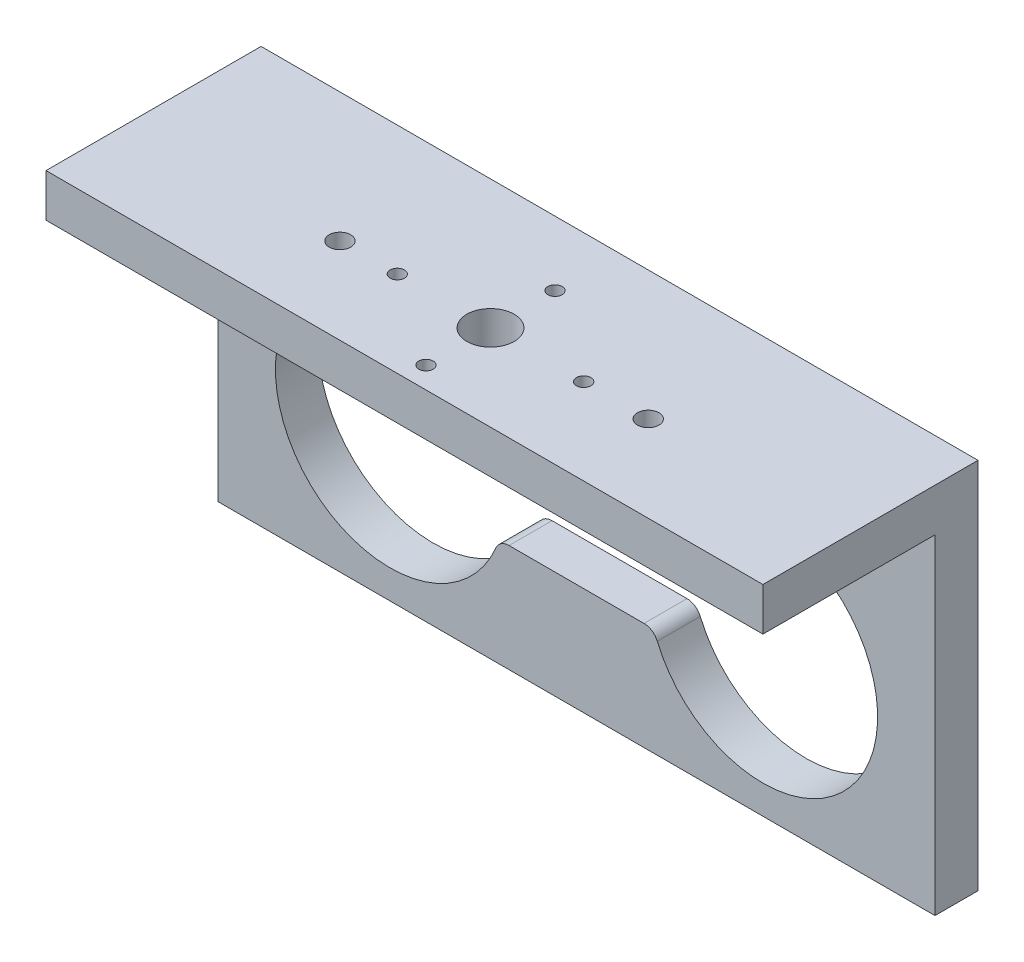
ISO-10303-21;
HEADER;
FILE_DESCRIPTION(('STEP AP214'),'2;1');
FILE_NAME('part.step','',(''),(''),'','','');
FILE_SCHEMA(('AUTOMOTIVE_DESIGN { 1 0 10303 214 1 1 1 1 }'));
ENDSEC;
DATA;
#1=APPLICATION_CONTEXT('core data for automotive mechanical design processes');
#2=APPLICATION_PROTOCOL_DEFINITION('international standard','automotive_design',2000,#1);
#3=PRODUCT_CONTEXT('',#1,'mechanical');
#4=PRODUCT('Part','Part','',(#3));
#5=PRODUCT_RELATED_PRODUCT_CATEGORY('part','',(#4));
#6=PRODUCT_DEFINITION_FORMATION('','',#4);
#7=PRODUCT_DEFINITION_CONTEXT('part definition',#1,'design');
#8=PRODUCT_DEFINITION('design','',#6,#7);
#9=PRODUCT_DEFINITION_SHAPE('','',#8);
#10=(LENGTH_UNIT() NAMED_UNIT(*) SI_UNIT(.MILLI.,.METRE.));
#11=(NAMED_UNIT(*) PLANE_ANGLE_UNIT() SI_UNIT($,.RADIAN.));
#12=(NAMED_UNIT(*) SI_UNIT($,.STERADIAN.) SOLID_ANGLE_UNIT());
#13=UNCERTAINTY_MEASURE_WITH_UNIT(LENGTH_MEASURE(1.E-05),#10,'distance_accuracy_value','');
#14=(GEOMETRIC_REPRESENTATION_CONTEXT(3) GLOBAL_UNCERTAINTY_ASSIGNED_CONTEXT((#13)) GLOBAL_UNIT_ASSIGNED_CONTEXT((#10,
#11,#12)) REPRESENTATION_CONTEXT('',''));
#15=CARTESIAN_POINT('',(0.,0.,0.));
#16=DIRECTION('',(0.,0.,1.));
#17=DIRECTION('',(1.,0.,0.));
#18=AXIS2_PLACEMENT_3D('',#15,#16,#17);
#19=CARTESIAN_POINT('',(-25.,16.,15.));
#20=DIRECTION('',(0.,0.,-1.));
#21=DIRECTION('',(-1.,0.,0.));
#22=AXIS2_PLACEMENT_3D('',#19,#20,#21);
#23=PLANE('',#22);
#24=DIRECTION('',(-1.,0.,0.));
#25=VECTOR('',#24,1.);
#26=CARTESIAN_POINT('',(25.,13.,15.));
#27=LINE('',#26,#25);
#28=CARTESIAN_POINT('',(25.,13.,15.));
#29=VERTEX_POINT('',#28);
#30=CARTESIAN_POINT('',(-25.,13.,15.));
#31=VERTEX_POINT('',#30);
#32=EDGE_CURVE('E168',#29,#31,#27,.T.);
#33=ORIENTED_EDGE('',*,*,#32,.F.);
#34=DIRECTION('',(0.,-1.,0.));
#35=VECTOR('',#34,1.);
#36=CARTESIAN_POINT('',(25.,16.,15.));
#37=LINE('',#36,#35);
#38=CARTESIAN_POINT('',(25.,16.,15.));
#39=VERTEX_POINT('',#38);
#40=EDGE_CURVE('E180',#39,#29,#37,.T.);
#41=ORIENTED_EDGE('',*,*,#40,.F.);
#42=DIRECTION('',(1.,0.,0.));
#43=VECTOR('',#42,1.);
#44=CARTESIAN_POINT('',(-25.,16.,15.));
#45=LINE('',#44,#43);
#46=CARTESIAN_POINT('',(-25.,16.,15.));
#47=VERTEX_POINT('',#46);
#48=EDGE_CURVE('E308',#47,#39,#45,.T.);
#49=ORIENTED_EDGE('',*,*,#48,.F.);
#50=DIRECTION('',(0.,-1.,0.));
#51=VECTOR('',#50,1.);
#52=CARTESIAN_POINT('',(-25.,16.,15.));
#53=LINE('',#52,#51);
#54=EDGE_CURVE('E183',#47,#31,#53,.T.);
#55=ORIENTED_EDGE('',*,*,#54,.T.);
#56=EDGE_LOOP('',(#33,#41,#49,#55));
#57=FACE_BOUND('',#56,.T.);
#58=ADVANCED_FACE('F37',(#57),#23,.F.);
#59=CARTESIAN_POINT('',(0.,0.,3.));
#60=DIRECTION('',(0.,0.,1.));
#61=DIRECTION('',(1.,0.,0.));
#62=AXIS2_PLACEMENT_3D('',#59,#60,#61);
#63=PLANE('',#62);
#64=DIRECTION('',(0.,-1.,0.));
#65=VECTOR('',#64,1.);
#66=CARTESIAN_POINT('',(-25.,-10.,3.));
#67=LINE('',#66,#65);
#68=CARTESIAN_POINT('',(-25.,13.,3.));
#69=VERTEX_POINT('',#68);
#70=CARTESIAN_POINT('',(-25.,-10.,3.));
#71=VERTEX_POINT('',#70);
#72=EDGE_CURVE('E281',#69,#71,#67,.T.);
#73=ORIENTED_EDGE('',*,*,#72,.T.);
#74=DIRECTION('',(1.,0.,0.));
#75=VECTOR('',#74,1.);
#76=CARTESIAN_POINT('',(25.,-10.,3.));
#77=LINE('',#76,#75);
#78=CARTESIAN_POINT('',(25.,-10.,3.));
#79=VERTEX_POINT('',#78);
#80=EDGE_CURVE('E284',#71,#79,#77,.T.);
#81=ORIENTED_EDGE('',*,*,#80,.T.);
#82=DIRECTION('',(0.,1.,0.));
#83=VECTOR('',#82,1.);
#84=CARTESIAN_POINT('',(25.,-10.,3.));
#85=LINE('',#84,#83);
#86=CARTESIAN_POINT('',(25.,13.,3.));
#87=VERTEX_POINT('',#86);
#88=EDGE_CURVE('E287',#79,#87,#85,.T.);
#89=ORIENTED_EDGE('',*,*,#88,.T.);
#90=DIRECTION('',(1.,0.,0.));
#91=VECTOR('',#90,1.);
#92=CARTESIAN_POINT('',(25.,13.,3.));
#93=LINE('',#92,#91);
#94=EDGE_CURVE('E171',#69,#87,#93,.T.);
#95=ORIENTED_EDGE('',*,*,#94,.F.);
#96=EDGE_LOOP('',(#73,#81,#89,#95));
#97=FACE_BOUND('',#96,.T.);
#98=CARTESIAN_POINT('',(13.,0.,3.));
#99=DIRECTION('',(0.,0.,1.));
#100=DIRECTION('',(1.,0.,0.));
#101=AXIS2_PLACEMENT_3D('',#98,#99,#100);
#102=CIRCLE('',#101,8.);
#103=CARTESIAN_POINT('',(5.62972268809911,-3.11111111111111,3.));
#104=VERTEX_POINT('',#103);
#105=CARTESIAN_POINT('',(5.62972268809911,3.11111111111111,3.));
#106=VERTEX_POINT('',#105);
#107=EDGE_CURVE('E224',#104,#106,#102,.T.);
#108=ORIENTED_EDGE('',*,*,#107,.F.);
#109=CARTESIAN_POINT('',(4.7084380241115,-3.5,3.));
#110=DIRECTION('',(0.,0.,-1.));
#111=DIRECTION('',(-1.,0.,0.));
#112=AXIS2_PLACEMENT_3D('',#109,#110,#111);
#113=CIRCLE('',#112,1.);
#114=CARTESIAN_POINT('',(4.7084380241115,-2.5,3.));
#115=VERTEX_POINT('',#114);
#116=EDGE_CURVE('E222',#115,#104,#113,.T.);
#117=ORIENTED_EDGE('',*,*,#116,.F.);
#118=DIRECTION('',(1.,0.,0.));
#119=VECTOR('',#118,1.);
#120=CARTESIAN_POINT('',(4.7084380241115,-2.5,3.));
#121=LINE('',#120,#119);
#122=CARTESIAN_POINT('',(-4.7084380241115,-2.5,3.));
#123=VERTEX_POINT('',#122);
#124=EDGE_CURVE('E238',#123,#115,#121,.T.);
#125=ORIENTED_EDGE('',*,*,#124,.F.);
#126=CARTESIAN_POINT('',(-4.7084380241115,-3.5,3.));
#127=DIRECTION('',(0.,0.,-1.));
#128=DIRECTION('',(1.,0.,0.));
#129=AXIS2_PLACEMENT_3D('',#126,#127,#128);
#130=CIRCLE('',#129,1.);
#131=CARTESIAN_POINT('',(-5.62972268809911,-3.11111111111111,3.));
#132=VERTEX_POINT('',#131);
#133=EDGE_CURVE('E235',#132,#123,#130,.T.);
#134=ORIENTED_EDGE('',*,*,#133,.F.);
#135=CARTESIAN_POINT('',(-13.,0.,3.));
#136=DIRECTION('',(0.,0.,1.));
#137=DIRECTION('',(1.,0.,0.));
#138=AXIS2_PLACEMENT_3D('',#135,#136,#137);
#139=CIRCLE('',#138,8.);
#140=CARTESIAN_POINT('',(-5.62972268809911,3.11111111111111,3.));
#141=VERTEX_POINT('',#140);
#142=EDGE_CURVE('E233',#141,#132,#139,.T.);
#143=ORIENTED_EDGE('',*,*,#142,.F.);
#144=CARTESIAN_POINT('',(-4.7084380241115,3.5,3.));
#145=DIRECTION('',(0.,0.,-1.));
#146=DIRECTION('',(-1.,0.,0.));
#147=AXIS2_PLACEMENT_3D('',#144,#145,#146);
#148=CIRCLE('',#147,1.);
#149=CARTESIAN_POINT('',(-4.7084380241115,2.5,3.));
#150=VERTEX_POINT('',#149);
#151=EDGE_CURVE('E231',#150,#141,#148,.T.);
#152=ORIENTED_EDGE('',*,*,#151,.F.);
#153=DIRECTION('',(-1.,0.,0.));
#154=VECTOR('',#153,1.);
#155=CARTESIAN_POINT('',(-4.7084380241115,2.5,3.));
#156=LINE('',#155,#154);
#157=CARTESIAN_POINT('',(4.7084380241115,2.5,3.));
#158=VERTEX_POINT('',#157);
#159=EDGE_CURVE('E229',#158,#150,#156,.T.);
#160=ORIENTED_EDGE('',*,*,#159,.F.);
#161=CARTESIAN_POINT('',(4.7084380241115,3.5,3.));
#162=DIRECTION('',(0.,0.,-1.));
#163=DIRECTION('',(1.,0.,0.));
#164=AXIS2_PLACEMENT_3D('',#161,#162,#163);
#165=CIRCLE('',#164,1.);
#166=EDGE_CURVE('E227',#106,#158,#165,.T.);
#167=ORIENTED_EDGE('',*,*,#166,.F.);
#168=EDGE_LOOP('',(#108,#117,#125,#134,#143,#152,#160,#167));
#169=FACE_BOUND('',#168,.T.);
#170=DIRECTION('',(-1.,0.,0.));
#171=VECTOR('',#170,1.);
#172=CARTESIAN_POINT('',(3.25,9.,3.));
#173=LINE('',#172,#171);
#174=CARTESIAN_POINT('',(3.25,9.,3.));
#175=VERTEX_POINT('',#174);
#176=CARTESIAN_POINT('',(-3.25,9.,3.));
#177=VERTEX_POINT('',#176);
#178=EDGE_CURVE('E198',#175,#177,#173,.T.);
#179=ORIENTED_EDGE('',*,*,#178,.F.);
#180=CARTESIAN_POINT('',(3.25,7.25,3.));
#181=DIRECTION('',(0.,0.,1.));
#182=DIRECTION('',(1.,0.,0.));
#183=AXIS2_PLACEMENT_3D('',#180,#181,#182);
#184=CIRCLE('',#183,1.75);
#185=CARTESIAN_POINT('',(3.25,5.5,3.));
#186=VERTEX_POINT('',#185);
#187=EDGE_CURVE('E196',#186,#175,#184,.T.);
#188=ORIENTED_EDGE('',*,*,#187,.F.);
#189=DIRECTION('',(1.,0.,0.));
#190=VECTOR('',#189,1.);
#191=CARTESIAN_POINT('',(3.25,5.5,3.));
#192=LINE('',#191,#190);
#193=CARTESIAN_POINT('',(-3.25,5.5,3.));
#194=VERTEX_POINT('',#193);
#195=EDGE_CURVE('E203',#194,#186,#192,.T.);
#196=ORIENTED_EDGE('',*,*,#195,.F.);
#197=CARTESIAN_POINT('',(-3.25,7.25,3.));
#198=DIRECTION('',(0.,0.,1.));
#199=DIRECTION('',(1.,0.,0.));
#200=AXIS2_PLACEMENT_3D('',#197,#198,#199);
#201=CIRCLE('',#200,1.75);
#202=EDGE_CURVE('E201',#177,#194,#201,.T.);
#203=ORIENTED_EDGE('',*,*,#202,.F.);
#204=EDGE_LOOP('',(#179,#188,#196,#203));
#205=FACE_BOUND('',#204,.T.);
#206=ADVANCED_FACE('F382',(#97,#169,#205),#63,.T.);
#207=CARTESIAN_POINT('',(0.,0.,0.));
#208=DIRECTION('',(0.,0.,1.));
#209=DIRECTION('',(1.,0.,0.));
#210=AXIS2_PLACEMENT_3D('',#207,#208,#209);
#211=PLANE('',#210);
#212=CARTESIAN_POINT('',(4.7084380241115,-3.5,0.));
#213=DIRECTION('',(0.,0.,-1.));
#214=DIRECTION('',(-1.,0.,0.));
#215=AXIS2_PLACEMENT_3D('',#212,#213,#214);
#216=CIRCLE('',#215,1.);
#217=CARTESIAN_POINT('',(4.7084380241115,-2.5,0.));
#218=VERTEX_POINT('',#217);
#219=CARTESIAN_POINT('',(5.62972268809911,-3.11111111111111,0.));
#220=VERTEX_POINT('',#219);
#221=EDGE_CURVE('E221',#218,#220,#216,.T.);
#222=ORIENTED_EDGE('',*,*,#221,.T.);
#223=CARTESIAN_POINT('',(13.,0.,0.));
#224=DIRECTION('',(0.,0.,1.));
#225=DIRECTION('',(1.,0.,0.));
#226=AXIS2_PLACEMENT_3D('',#223,#224,#225);
#227=CIRCLE('',#226,8.);
#228=CARTESIAN_POINT('',(5.62972268809911,3.11111111111111,0.));
#229=VERTEX_POINT('',#228);
#230=EDGE_CURVE('E243',#220,#229,#227,.T.);
#231=ORIENTED_EDGE('',*,*,#230,.T.);
#232=CARTESIAN_POINT('',(4.7084380241115,3.5,0.));
#233=DIRECTION('',(0.,0.,-1.));
#234=DIRECTION('',(1.,0.,0.));
#235=AXIS2_PLACEMENT_3D('',#232,#233,#234);
#236=CIRCLE('',#235,1.);
#237=CARTESIAN_POINT('',(4.7084380241115,2.5,0.));
#238=VERTEX_POINT('',#237);
#239=EDGE_CURVE('E246',#229,#238,#236,.T.);
#240=ORIENTED_EDGE('',*,*,#239,.T.);
#241=DIRECTION('',(-1.,0.,0.));
#242=VECTOR('',#241,1.);
#243=CARTESIAN_POINT('',(-4.7084380241115,2.5,0.));
#244=LINE('',#243,#242);
#245=CARTESIAN_POINT('',(-4.7084380241115,2.5,0.));
#246=VERTEX_POINT('',#245);
#247=EDGE_CURVE('E249',#238,#246,#244,.T.);
#248=ORIENTED_EDGE('',*,*,#247,.T.);
#249=CARTESIAN_POINT('',(-4.7084380241115,3.5,0.));
#250=DIRECTION('',(0.,0.,-1.));
#251=DIRECTION('',(-1.,0.,0.));
#252=AXIS2_PLACEMENT_3D('',#249,#250,#251);
#253=CIRCLE('',#252,1.);
#254=CARTESIAN_POINT('',(-5.62972268809911,3.11111111111111,0.));
#255=VERTEX_POINT('',#254);
#256=EDGE_CURVE('E252',#246,#255,#253,.T.);
#257=ORIENTED_EDGE('',*,*,#256,.T.);
#258=CARTESIAN_POINT('',(-13.,0.,0.));
#259=DIRECTION('',(0.,0.,1.));
#260=DIRECTION('',(1.,0.,0.));
#261=AXIS2_PLACEMENT_3D('',#258,#259,#260);
#262=CIRCLE('',#261,8.);
#263=CARTESIAN_POINT('',(-5.62972268809911,-3.11111111111111,0.));
#264=VERTEX_POINT('',#263);
#265=EDGE_CURVE('E255',#255,#264,#262,.T.);
#266=ORIENTED_EDGE('',*,*,#265,.T.);
#267=CARTESIAN_POINT('',(-4.7084380241115,-3.5,0.));
#268=DIRECTION('',(0.,0.,-1.));
#269=DIRECTION('',(1.,0.,0.));
#270=AXIS2_PLACEMENT_3D('',#267,#268,#269);
#271=CIRCLE('',#270,1.);
#272=CARTESIAN_POINT('',(-4.7084380241115,-2.5,0.));
#273=VERTEX_POINT('',#272);
#274=EDGE_CURVE('E258',#264,#273,#271,.T.);
#275=ORIENTED_EDGE('',*,*,#274,.T.);
#276=DIRECTION('',(1.,0.,0.));
#277=VECTOR('',#276,1.);
#278=CARTESIAN_POINT('',(4.7084380241115,-2.5,0.));
#279=LINE('',#278,#277);
#280=EDGE_CURVE('E225',#273,#218,#279,.T.);
#281=ORIENTED_EDGE('',*,*,#280,.T.);
#282=EDGE_LOOP('',(#222,#231,#240,#248,#257,#266,#275,#281));
#283=FACE_BOUND('',#282,.T.);
#284=DIRECTION('',(0.,-1.,0.));
#285=VECTOR('',#284,1.);
#286=CARTESIAN_POINT('',(-25.,-10.,0.));
#287=LINE('',#286,#285);
#288=CARTESIAN_POINT('',(-25.,16.,0.));
#289=VERTEX_POINT('',#288);
#290=CARTESIAN_POINT('',(-25.,-10.,0.));
#291=VERTEX_POINT('',#290);
#292=EDGE_CURVE('E280',#289,#291,#287,.T.);
#293=ORIENTED_EDGE('',*,*,#292,.F.);
#294=DIRECTION('',(-1.,0.,0.));
#295=VECTOR('',#294,1.);
#296=CARTESIAN_POINT('',(-25.,16.,0.));
#297=LINE('',#296,#295);
#298=CARTESIAN_POINT('',(25.,16.,0.));
#299=VERTEX_POINT('',#298);
#300=EDGE_CURVE('E189',#299,#289,#297,.T.);
#301=ORIENTED_EDGE('',*,*,#300,.F.);
#302=DIRECTION('',(0.,1.,0.));
#303=VECTOR('',#302,1.);
#304=CARTESIAN_POINT('',(25.,-10.,0.));
#305=LINE('',#304,#303);
#306=CARTESIAN_POINT('',(25.,-10.,0.));
#307=VERTEX_POINT('',#306);
#308=EDGE_CURVE('E285',#307,#299,#305,.T.);
#309=ORIENTED_EDGE('',*,*,#308,.F.);
#310=DIRECTION('',(1.,0.,0.));
#311=VECTOR('',#310,1.);
#312=CARTESIAN_POINT('',(25.,-10.,0.));
#313=LINE('',#312,#311);
#314=EDGE_CURVE('E291',#291,#307,#313,.T.);
#315=ORIENTED_EDGE('',*,*,#314,.F.);
#316=EDGE_LOOP('',(#293,#301,#309,#315));
#317=FACE_BOUND('',#316,.T.);
#318=CARTESIAN_POINT('',(3.25,7.25,0.));
#319=DIRECTION('',(0.,0.,1.));
#320=DIRECTION('',(1.,0.,0.));
#321=AXIS2_PLACEMENT_3D('',#318,#319,#320);
#322=CIRCLE('',#321,1.75);
#323=CARTESIAN_POINT('',(3.25,5.5,0.));
#324=VERTEX_POINT('',#323);
#325=CARTESIAN_POINT('',(3.25,9.,0.));
#326=VERTEX_POINT('',#325);
#327=EDGE_CURVE('E60',#324,#326,#322,.T.);
#328=ORIENTED_EDGE('',*,*,#327,.T.);
#329=DIRECTION('',(-1.,0.,0.));
#330=VECTOR('',#329,1.);
#331=CARTESIAN_POINT('',(3.25,9.,0.));
#332=LINE('',#331,#330);
#333=CARTESIAN_POINT('',(-3.25,9.,0.));
#334=VERTEX_POINT('',#333);
#335=EDGE_CURVE('E207',#326,#334,#332,.T.);
#336=ORIENTED_EDGE('',*,*,#335,.T.);
#337=CARTESIAN_POINT('',(-3.25,7.25,0.));
#338=DIRECTION('',(0.,0.,1.));
#339=DIRECTION('',(1.,0.,0.));
#340=AXIS2_PLACEMENT_3D('',#337,#338,#339);
#341=CIRCLE('',#340,1.75);
#342=CARTESIAN_POINT('',(-3.25,5.5,0.));
#343=VERTEX_POINT('',#342);
#344=EDGE_CURVE('E210',#334,#343,#341,.T.);
#345=ORIENTED_EDGE('',*,*,#344,.T.);
#346=DIRECTION('',(1.,0.,0.));
#347=VECTOR('',#346,1.);
#348=CARTESIAN_POINT('',(3.25,5.5,0.));
#349=LINE('',#348,#347);
#350=EDGE_CURVE('E199',#343,#324,#349,.T.);
#351=ORIENTED_EDGE('',*,*,#350,.T.);
#352=EDGE_LOOP('',(#328,#336,#345,#351));
#353=FACE_BOUND('',#352,.T.);
#354=ADVANCED_FACE('F299',(#283,#317,#353),#211,.F.);
#355=CARTESIAN_POINT('',(-25.,-10.,3.));
#356=DIRECTION('',(1.,0.,0.));
#357=DIRECTION('',(0.,0.,-1.));
#358=AXIS2_PLACEMENT_3D('',#355,#356,#357);
#359=PLANE('',#358);
#360=ORIENTED_EDGE('',*,*,#72,.F.);
#361=DIRECTION('',(0.,0.,-1.));
#362=VECTOR('',#361,1.);
#363=CARTESIAN_POINT('',(-25.,13.,3.));
#364=LINE('',#363,#362);
#365=EDGE_CURVE('E184',#31,#69,#364,.T.);
#366=ORIENTED_EDGE('',*,*,#365,.F.);
#367=ORIENTED_EDGE('',*,*,#54,.F.);
#368=DIRECTION('',(0.,0.,1.));
#369=VECTOR('',#368,1.);
#370=CARTESIAN_POINT('',(-25.,16.,0.));
#371=LINE('',#370,#369);
#372=EDGE_CURVE('E305',#289,#47,#371,.T.);
#373=ORIENTED_EDGE('',*,*,#372,.F.);
#374=ORIENTED_EDGE('',*,*,#292,.T.);
#375=DIRECTION('',(0.,0.,-1.));
#376=VECTOR('',#375,1.);
#377=CARTESIAN_POINT('',(-25.,-10.,3.));
#378=LINE('',#377,#376);
#379=EDGE_CURVE('E11',#71,#291,#378,.T.);
#380=ORIENTED_EDGE('',*,*,#379,.F.);
#381=EDGE_LOOP('',(#360,#366,#367,#373,#374,#380));
#382=FACE_BOUND('',#381,.T.);
#383=ADVANCED_FACE('F39',(#382),#359,.F.);
#384=CARTESIAN_POINT('',(25.,-10.,3.));
#385=DIRECTION('',(0.,1.,0.));
#386=DIRECTION('',(-1.,0.,0.));
#387=AXIS2_PLACEMENT_3D('',#384,#385,#386);
#388=PLANE('',#387);
#389=ORIENTED_EDGE('',*,*,#314,.T.);
#390=DIRECTION('',(0.,0.,-1.));
#391=VECTOR('',#390,1.);
#392=CARTESIAN_POINT('',(25.,-10.,3.));
#393=LINE('',#392,#391);
#394=EDGE_CURVE('E45',#79,#307,#393,.T.);
#395=ORIENTED_EDGE('',*,*,#394,.F.);
#396=ORIENTED_EDGE('',*,*,#80,.F.);
#397=ORIENTED_EDGE('',*,*,#379,.T.);
#398=EDGE_LOOP('',(#389,#395,#396,#397));
#399=FACE_BOUND('',#398,.T.);
#400=ADVANCED_FACE('F439',(#399),#388,.F.);
#401=CARTESIAN_POINT('',(25.,-10.,3.));
#402=DIRECTION('',(-1.,0.,0.));
#403=DIRECTION('',(0.,0.,1.));
#404=AXIS2_PLACEMENT_3D('',#401,#402,#403);
#405=PLANE('',#404);
#406=DIRECTION('',(0.,0.,1.));
#407=VECTOR('',#406,1.);
#408=CARTESIAN_POINT('',(25.,13.,3.));
#409=LINE('',#408,#407);
#410=EDGE_CURVE('E164',#87,#29,#409,.T.);
#411=ORIENTED_EDGE('',*,*,#410,.F.);
#412=ORIENTED_EDGE('',*,*,#88,.F.);
#413=ORIENTED_EDGE('',*,*,#394,.T.);
#414=ORIENTED_EDGE('',*,*,#308,.T.);
#415=DIRECTION('',(0.,0.,-1.));
#416=VECTOR('',#415,1.);
#417=CARTESIAN_POINT('',(25.,16.,0.));
#418=LINE('',#417,#416);
#419=EDGE_CURVE('E188',#39,#299,#418,.T.);
#420=ORIENTED_EDGE('',*,*,#419,.F.);
#421=ORIENTED_EDGE('',*,*,#40,.T.);
#422=EDGE_LOOP('',(#411,#412,#413,#414,#420,#421));
#423=FACE_BOUND('',#422,.T.);
#424=ADVANCED_FACE('F186',(#423),#405,.F.);
#425=CARTESIAN_POINT('',(4.7084380241115,-3.5,3.));
#426=DIRECTION('',(0.,0.,-1.));
#427=DIRECTION('',(-1.,0.,0.));
#428=AXIS2_PLACEMENT_3D('',#425,#426,#427);
#429=CYLINDRICAL_SURFACE('',#428,1.);
#430=ORIENTED_EDGE('',*,*,#221,.F.);
#431=DIRECTION('',(0.,0.,-1.));
#432=VECTOR('',#431,1.);
#433=CARTESIAN_POINT('',(4.7084380241115,-2.5,3.));
#434=LINE('',#433,#432);
#435=EDGE_CURVE('E240',#115,#218,#434,.T.);
#436=ORIENTED_EDGE('',*,*,#435,.F.);
#437=ORIENTED_EDGE('',*,*,#116,.T.);
#438=DIRECTION('',(0.,0.,-1.));
#439=VECTOR('',#438,1.);
#440=CARTESIAN_POINT('',(5.62972268809911,-3.11111111111111,3.));
#441=LINE('',#440,#439);
#442=EDGE_CURVE('E277',#104,#220,#441,.T.);
#443=ORIENTED_EDGE('',*,*,#442,.T.);
#444=EDGE_LOOP('',(#430,#436,#437,#443));
#445=FACE_BOUND('',#444,.T.);
#446=ADVANCED_FACE('F430',(#445),#429,.T.);
#447=CARTESIAN_POINT('',(13.,0.,3.));
#448=DIRECTION('',(0.,0.,-1.));
#449=DIRECTION('',(-1.,0.,0.));
#450=AXIS2_PLACEMENT_3D('',#447,#448,#449);
#451=CYLINDRICAL_SURFACE('',#450,8.);
#452=ORIENTED_EDGE('',*,*,#230,.F.);
#453=ORIENTED_EDGE('',*,*,#442,.F.);
#454=ORIENTED_EDGE('',*,*,#107,.T.);
#455=DIRECTION('',(0.,0.,-1.));
#456=VECTOR('',#455,1.);
#457=CARTESIAN_POINT('',(5.62972268809911,3.11111111111111,3.));
#458=LINE('',#457,#456);
#459=EDGE_CURVE('E275',#106,#229,#458,.T.);
#460=ORIENTED_EDGE('',*,*,#459,.T.);
#461=EDGE_LOOP('',(#452,#453,#454,#460));
#462=FACE_BOUND('',#461,.T.);
#463=ADVANCED_FACE('F426',(#462),#451,.F.);
#464=CARTESIAN_POINT('',(4.7084380241115,3.5,3.));
#465=DIRECTION('',(0.,0.,-1.));
#466=DIRECTION('',(-1.,0.,0.));
#467=AXIS2_PLACEMENT_3D('',#464,#465,#466);
#468=CYLINDRICAL_SURFACE('',#467,1.);
#469=ORIENTED_EDGE('',*,*,#239,.F.);
#470=ORIENTED_EDGE('',*,*,#459,.F.);
#471=ORIENTED_EDGE('',*,*,#166,.T.);
#472=DIRECTION('',(0.,0.,-1.));
#473=VECTOR('',#472,1.);
#474=CARTESIAN_POINT('',(4.7084380241115,2.5,3.));
#475=LINE('',#474,#473);
#476=EDGE_CURVE('E273',#158,#238,#475,.T.);
#477=ORIENTED_EDGE('',*,*,#476,.T.);
#478=EDGE_LOOP('',(#469,#470,#471,#477));
#479=FACE_BOUND('',#478,.T.);
#480=ADVANCED_FACE('F422',(#479),#468,.T.);
#481=CARTESIAN_POINT('',(-4.7084380241115,2.5,3.));
#482=DIRECTION('',(0.,-1.,0.));
#483=DIRECTION('',(0.,0.,-1.));
#484=AXIS2_PLACEMENT_3D('',#481,#482,#483);
#485=PLANE('',#484);
#486=ORIENTED_EDGE('',*,*,#247,.F.);
#487=ORIENTED_EDGE('',*,*,#476,.F.);
#488=ORIENTED_EDGE('',*,*,#159,.T.);
#489=DIRECTION('',(0.,0.,-1.));
#490=VECTOR('',#489,1.);
#491=CARTESIAN_POINT('',(-4.7084380241115,2.5,3.));
#492=LINE('',#491,#490);
#493=EDGE_CURVE('E271',#150,#246,#492,.T.);
#494=ORIENTED_EDGE('',*,*,#493,.T.);
#495=EDGE_LOOP('',(#486,#487,#488,#494));
#496=FACE_BOUND('',#495,.T.);
#497=ADVANCED_FACE('F418',(#496),#485,.T.);
#498=CARTESIAN_POINT('',(-4.7084380241115,3.5,3.));
#499=DIRECTION('',(0.,0.,-1.));
#500=DIRECTION('',(-1.,0.,0.));
#501=AXIS2_PLACEMENT_3D('',#498,#499,#500);
#502=CYLINDRICAL_SURFACE('',#501,1.);
#503=ORIENTED_EDGE('',*,*,#256,.F.);
#504=ORIENTED_EDGE('',*,*,#493,.F.);
#505=ORIENTED_EDGE('',*,*,#151,.T.);
#506=DIRECTION('',(0.,0.,-1.));
#507=VECTOR('',#506,1.);
#508=CARTESIAN_POINT('',(-5.62972268809911,3.11111111111111,3.));
#509=LINE('',#508,#507);
#510=EDGE_CURVE('E269',#141,#255,#509,.T.);
#511=ORIENTED_EDGE('',*,*,#510,.T.);
#512=EDGE_LOOP('',(#503,#504,#505,#511));
#513=FACE_BOUND('',#512,.T.);
#514=ADVANCED_FACE('F414',(#513),#502,.T.);
#515=CARTESIAN_POINT('',(-13.,0.,3.));
#516=DIRECTION('',(0.,0.,-1.));
#517=DIRECTION('',(-1.,0.,0.));
#518=AXIS2_PLACEMENT_3D('',#515,#516,#517);
#519=CYLINDRICAL_SURFACE('',#518,8.);
#520=ORIENTED_EDGE('',*,*,#265,.F.);
#521=ORIENTED_EDGE('',*,*,#510,.F.);
#522=ORIENTED_EDGE('',*,*,#142,.T.);
#523=DIRECTION('',(0.,0.,-1.));
#524=VECTOR('',#523,1.);
#525=CARTESIAN_POINT('',(-5.62972268809911,-3.11111111111111,3.));
#526=LINE('',#525,#524);
#527=EDGE_CURVE('E267',#132,#264,#526,.T.);
#528=ORIENTED_EDGE('',*,*,#527,.T.);
#529=EDGE_LOOP('',(#520,#521,#522,#528));
#530=FACE_BOUND('',#529,.T.);
#531=ADVANCED_FACE('F410',(#530),#519,.F.);
#532=CARTESIAN_POINT('',(-4.7084380241115,-3.5,3.));
#533=DIRECTION('',(0.,0.,-1.));
#534=DIRECTION('',(-1.,0.,0.));
#535=AXIS2_PLACEMENT_3D('',#532,#533,#534);
#536=CYLINDRICAL_SURFACE('',#535,1.);
#537=ORIENTED_EDGE('',*,*,#274,.F.);
#538=ORIENTED_EDGE('',*,*,#527,.F.);
#539=ORIENTED_EDGE('',*,*,#133,.T.);
#540=DIRECTION('',(0.,0.,-1.));
#541=VECTOR('',#540,1.);
#542=CARTESIAN_POINT('',(-4.7084380241115,-2.5,3.));
#543=LINE('',#542,#541);
#544=EDGE_CURVE('E265',#123,#273,#543,.T.);
#545=ORIENTED_EDGE('',*,*,#544,.T.);
#546=EDGE_LOOP('',(#537,#538,#539,#545));
#547=FACE_BOUND('',#546,.T.);
#548=ADVANCED_FACE('F406',(#547),#536,.T.);
#549=CARTESIAN_POINT('',(4.7084380241115,-2.5,3.));
#550=DIRECTION('',(0.,1.,0.));
#551=DIRECTION('',(-1.,0.,0.));
#552=AXIS2_PLACEMENT_3D('',#549,#550,#551);
#553=PLANE('',#552);
#554=ORIENTED_EDGE('',*,*,#280,.F.);
#555=ORIENTED_EDGE('',*,*,#544,.F.);
#556=ORIENTED_EDGE('',*,*,#124,.T.);
#557=ORIENTED_EDGE('',*,*,#435,.T.);
#558=EDGE_LOOP('',(#554,#555,#556,#557));
#559=FACE_BOUND('',#558,.T.);
#560=ADVANCED_FACE('F403',(#559),#553,.T.);
#561=CARTESIAN_POINT('',(3.25,7.25,3.));
#562=DIRECTION('',(0.,0.,-1.));
#563=DIRECTION('',(-1.,0.,0.));
#564=AXIS2_PLACEMENT_3D('',#561,#562,#563);
#565=CYLINDRICAL_SURFACE('',#564,1.75);
#566=ORIENTED_EDGE('',*,*,#327,.F.);
#567=DIRECTION('',(0.,0.,-1.));
#568=VECTOR('',#567,1.);
#569=CARTESIAN_POINT('',(3.25,5.5,3.));
#570=LINE('',#569,#568);
#571=EDGE_CURVE('E205',#186,#324,#570,.T.);
#572=ORIENTED_EDGE('',*,*,#571,.F.);
#573=ORIENTED_EDGE('',*,*,#187,.T.);
#574=DIRECTION('',(0.,0.,-1.));
#575=VECTOR('',#574,1.);
#576=CARTESIAN_POINT('',(3.25,9.,3.));
#577=LINE('',#576,#575);
#578=EDGE_CURVE('E219',#175,#326,#577,.T.);
#579=ORIENTED_EDGE('',*,*,#578,.T.);
#580=EDGE_LOOP('',(#566,#572,#573,#579));
#581=FACE_BOUND('',#580,.T.);
#582=ADVANCED_FACE('F399',(#581),#565,.F.);
#583=CARTESIAN_POINT('',(3.25,9.,3.));
#584=DIRECTION('',(0.,-1.,0.));
#585=DIRECTION('',(1.,0.,0.));
#586=AXIS2_PLACEMENT_3D('',#583,#584,#585);
#587=PLANE('',#586);
#588=ORIENTED_EDGE('',*,*,#335,.F.);
#589=ORIENTED_EDGE('',*,*,#578,.F.);
#590=ORIENTED_EDGE('',*,*,#178,.T.);
#591=DIRECTION('',(0.,0.,-1.));
#592=VECTOR('',#591,1.);
#593=CARTESIAN_POINT('',(-3.25,9.,3.));
#594=LINE('',#593,#592);
#595=EDGE_CURVE('E217',#177,#334,#594,.T.);
#596=ORIENTED_EDGE('',*,*,#595,.T.);
#597=EDGE_LOOP('',(#588,#589,#590,#596));
#598=FACE_BOUND('',#597,.T.);
#599=ADVANCED_FACE('F395',(#598),#587,.T.);
#600=CARTESIAN_POINT('',(-3.25,7.25,3.));
#601=DIRECTION('',(0.,0.,-1.));
#602=DIRECTION('',(-1.,0.,0.));
#603=AXIS2_PLACEMENT_3D('',#600,#601,#602);
#604=CYLINDRICAL_SURFACE('',#603,1.75);
#605=ORIENTED_EDGE('',*,*,#344,.F.);
#606=ORIENTED_EDGE('',*,*,#595,.F.);
#607=ORIENTED_EDGE('',*,*,#202,.T.);
#608=DIRECTION('',(0.,0.,-1.));
#609=VECTOR('',#608,1.);
#610=CARTESIAN_POINT('',(-3.25,5.5,3.));
#611=LINE('',#610,#609);
#612=EDGE_CURVE('E52',#194,#343,#611,.T.);
#613=ORIENTED_EDGE('',*,*,#612,.T.);
#614=EDGE_LOOP('',(#605,#606,#607,#613));
#615=FACE_BOUND('',#614,.T.);
#616=ADVANCED_FACE('F392',(#615),#604,.F.);
#617=CARTESIAN_POINT('',(3.25,5.5,3.));
#618=DIRECTION('',(0.,1.,0.));
#619=DIRECTION('',(0.,0.,1.));
#620=AXIS2_PLACEMENT_3D('',#617,#618,#619);
#621=PLANE('',#620);
#622=ORIENTED_EDGE('',*,*,#350,.F.);
#623=ORIENTED_EDGE('',*,*,#612,.F.);
#624=ORIENTED_EDGE('',*,*,#195,.T.);
#625=ORIENTED_EDGE('',*,*,#571,.T.);
#626=EDGE_LOOP('',(#622,#623,#624,#625));
#627=FACE_BOUND('',#626,.T.);
#628=ADVANCED_FACE('F361',(#627),#621,.T.);
#629=CARTESIAN_POINT('',(0.,16.,0.));
#630=DIRECTION('',(0.,1.,0.));
#631=DIRECTION('',(-1.,0.,0.));
#632=AXIS2_PLACEMENT_3D('',#629,#630,#631);
#633=PLANE('',#632);
#634=CARTESIAN_POINT('',(-10.5,16.,9.));
#635=DIRECTION('',(0.,1.,0.));
#636=DIRECTION('',(-1.,0.,0.));
#637=AXIS2_PLACEMENT_3D('',#634,#635,#636);
#638=CIRCLE('',#637,0.75);
#639=CARTESIAN_POINT('',(-11.25,16.,9.));
#640=VERTEX_POINT('',#639);
#641=EDGE_CURVE('E336',#640,#640,#638,.T.);
#642=ORIENTED_EDGE('',*,*,#641,.F.);
#643=EDGE_LOOP('',(#642));
#644=FACE_BOUND('',#643,.T.);
#645=CARTESIAN_POINT('',(11.,16.,9.));
#646=DIRECTION('',(0.,1.,0.));
#647=DIRECTION('',(-1.,0.,0.));
#648=AXIS2_PLACEMENT_3D('',#645,#646,#647);
#649=CIRCLE('',#648,0.75);
#650=CARTESIAN_POINT('',(10.25,16.,9.));
#651=VERTEX_POINT('',#650);
#652=EDGE_CURVE('E335',#651,#651,#649,.T.);
#653=ORIENTED_EDGE('',*,*,#652,.F.);
#654=EDGE_LOOP('',(#653));
#655=FACE_BOUND('',#654,.T.);
#656=CARTESIAN_POINT('',(-6.5,16.,9.));
#657=DIRECTION('',(0.,1.,0.));
#658=DIRECTION('',(-1.,0.,0.));
#659=AXIS2_PLACEMENT_3D('',#656,#657,#658);
#660=CIRCLE('',#659,0.500000000000002);
#661=CARTESIAN_POINT('',(-7.,16.,9.));
#662=VERTEX_POINT('',#661);
#663=EDGE_CURVE('E324',#662,#662,#660,.T.);
#664=ORIENTED_EDGE('',*,*,#663,.F.);
#665=EDGE_LOOP('',(#664));
#666=FACE_BOUND('',#665,.T.);
#667=CARTESIAN_POINT('',(6.5,16.,9.));
#668=DIRECTION('',(0.,1.,0.));
#669=DIRECTION('',(-1.,0.,0.));
#670=AXIS2_PLACEMENT_3D('',#667,#668,#669);
#671=CIRCLE('',#670,0.500000000000002);
#672=CARTESIAN_POINT('',(6.,16.,9.));
#673=VERTEX_POINT('',#672);
#674=EDGE_CURVE('E323',#673,#673,#671,.T.);
#675=ORIENTED_EDGE('',*,*,#674,.F.);
#676=EDGE_LOOP('',(#675));
#677=FACE_BOUND('',#676,.T.);
#678=CARTESIAN_POINT('',(0.,16.,4.5));
#679=DIRECTION('',(0.,1.,0.));
#680=DIRECTION('',(-1.,0.,0.));
#681=AXIS2_PLACEMENT_3D('',#678,#679,#680);
#682=CIRCLE('',#681,0.5);
#683=CARTESIAN_POINT('',(-0.500000000000003,16.,4.5));
#684=VERTEX_POINT('',#683);
#685=EDGE_CURVE('E347',#684,#684,#682,.T.);
#686=ORIENTED_EDGE('',*,*,#685,.F.);
#687=EDGE_LOOP('',(#686));
#688=FACE_BOUND('',#687,.T.);
#689=CARTESIAN_POINT('',(0.,16.,13.5));
#690=DIRECTION('',(0.,1.,0.));
#691=DIRECTION('',(-1.,0.,0.));
#692=AXIS2_PLACEMENT_3D('',#689,#690,#691);
#693=CIRCLE('',#692,0.5);
#694=CARTESIAN_POINT('',(-0.500000000000003,16.,13.5));
#695=VERTEX_POINT('',#694);
#696=EDGE_CURVE('E348',#695,#695,#693,.T.);
#697=ORIENTED_EDGE('',*,*,#696,.F.);
#698=EDGE_LOOP('',(#697));
#699=FACE_BOUND('',#698,.T.);
#700=CARTESIAN_POINT('',(0.,16.,9.));
#701=DIRECTION('',(0.,1.,0.));
#702=DIRECTION('',(-1.,0.,0.));
#703=AXIS2_PLACEMENT_3D('',#700,#701,#702);
#704=CIRCLE('',#703,1.65);
#705=CARTESIAN_POINT('',(-1.65,16.,9.));
#706=VERTEX_POINT('',#705);
#707=EDGE_CURVE('E316',#706,#706,#704,.T.);
#708=ORIENTED_EDGE('',*,*,#707,.F.);
#709=EDGE_LOOP('',(#708));
#710=FACE_BOUND('',#709,.T.);
#711=ORIENTED_EDGE('',*,*,#372,.T.);
#712=ORIENTED_EDGE('',*,*,#48,.T.);
#713=ORIENTED_EDGE('',*,*,#419,.T.);
#714=ORIENTED_EDGE('',*,*,#300,.T.);
#715=EDGE_LOOP('',(#711,#712,#713,#714));
#716=FACE_BOUND('',#715,.T.);
#717=ADVANCED_FACE('F304',(#644,#655,#666,#677,#688,#699,#710,#716),#633,.T.);
#718=CARTESIAN_POINT('',(0.,13.,0.));
#719=DIRECTION('',(0.,-1.,0.));
#720=DIRECTION('',(1.,0.,0.));
#721=AXIS2_PLACEMENT_3D('',#718,#719,#720);
#722=PLANE('',#721);
#723=CARTESIAN_POINT('',(-10.5,13.,9.));
#724=DIRECTION('',(0.,-1.,0.));
#725=DIRECTION('',(1.,0.,0.));
#726=AXIS2_PLACEMENT_3D('',#723,#724,#725);
#727=CIRCLE('',#726,0.75);
#728=CARTESIAN_POINT('',(-9.75,13.,9.));
#729=VERTEX_POINT('',#728);
#730=EDGE_CURVE('E332',#729,#729,#727,.F.);
#731=ORIENTED_EDGE('',*,*,#730,.T.);
#732=EDGE_LOOP('',(#731));
#733=FACE_BOUND('',#732,.T.);
#734=CARTESIAN_POINT('',(11.,13.,9.));
#735=DIRECTION('',(0.,-1.,0.));
#736=DIRECTION('',(1.,0.,0.));
#737=AXIS2_PLACEMENT_3D('',#734,#735,#736);
#738=CIRCLE('',#737,0.75);
#739=CARTESIAN_POINT('',(11.75,13.,9.));
#740=VERTEX_POINT('',#739);
#741=EDGE_CURVE('E327',#740,#740,#738,.F.);
#742=ORIENTED_EDGE('',*,*,#741,.T.);
#743=EDGE_LOOP('',(#742));
#744=FACE_BOUND('',#743,.T.);
#745=CARTESIAN_POINT('',(-6.5,13.,9.));
#746=DIRECTION('',(0.,-1.,0.));
#747=DIRECTION('',(1.,0.,0.));
#748=AXIS2_PLACEMENT_3D('',#745,#746,#747);
#749=CIRCLE('',#748,0.500000000000002);
#750=CARTESIAN_POINT('',(-6.,13.,9.));
#751=VERTEX_POINT('',#750);
#752=EDGE_CURVE('E320',#751,#751,#749,.F.);
#753=ORIENTED_EDGE('',*,*,#752,.T.);
#754=EDGE_LOOP('',(#753));
#755=FACE_BOUND('',#754,.T.);
#756=CARTESIAN_POINT('',(6.5,13.,9.));
#757=DIRECTION('',(0.,-1.,0.));
#758=DIRECTION('',(1.,0.,0.));
#759=AXIS2_PLACEMENT_3D('',#756,#757,#758);
#760=CIRCLE('',#759,0.500000000000002);
#761=CARTESIAN_POINT('',(7.,13.,9.));
#762=VERTEX_POINT('',#761);
#763=EDGE_CURVE('E319',#762,#762,#760,.F.);
#764=ORIENTED_EDGE('',*,*,#763,.T.);
#765=EDGE_LOOP('',(#764));
#766=FACE_BOUND('',#765,.T.);
#767=CARTESIAN_POINT('',(0.,13.,4.5));
#768=DIRECTION('',(0.,-1.,0.));
#769=DIRECTION('',(1.,0.,0.));
#770=AXIS2_PLACEMENT_3D('',#767,#768,#769);
#771=CIRCLE('',#770,0.5);
#772=CARTESIAN_POINT('',(0.499999999999999,13.,4.5));
#773=VERTEX_POINT('',#772);
#774=EDGE_CURVE('E339',#773,#773,#771,.F.);
#775=ORIENTED_EDGE('',*,*,#774,.T.);
#776=EDGE_LOOP('',(#775));
#777=FACE_BOUND('',#776,.T.);
#778=CARTESIAN_POINT('',(0.,13.,13.5));
#779=DIRECTION('',(0.,-1.,0.));
#780=DIRECTION('',(1.,0.,0.));
#781=AXIS2_PLACEMENT_3D('',#778,#779,#780);
#782=CIRCLE('',#781,0.5);
#783=CARTESIAN_POINT('',(0.499999999999999,13.,13.5));
#784=VERTEX_POINT('',#783);
#785=EDGE_CURVE('E344',#784,#784,#782,.F.);
#786=ORIENTED_EDGE('',*,*,#785,.T.);
#787=EDGE_LOOP('',(#786));
#788=FACE_BOUND('',#787,.T.);
#789=CARTESIAN_POINT('',(0.,13.,9.));
#790=DIRECTION('',(0.,-1.,0.));
#791=DIRECTION('',(1.,0.,0.));
#792=AXIS2_PLACEMENT_3D('',#789,#790,#791);
#793=CIRCLE('',#792,1.65);
#794=CARTESIAN_POINT('',(1.65,13.,9.));
#795=VERTEX_POINT('',#794);
#796=EDGE_CURVE('E175',#795,#795,#793,.F.);
#797=ORIENTED_EDGE('',*,*,#796,.T.);
#798=EDGE_LOOP('',(#797));
#799=FACE_BOUND('',#798,.T.);
#800=ORIENTED_EDGE('',*,*,#410,.T.);
#801=ORIENTED_EDGE('',*,*,#32,.T.);
#802=ORIENTED_EDGE('',*,*,#365,.T.);
#803=ORIENTED_EDGE('',*,*,#94,.T.);
#804=EDGE_LOOP('',(#800,#801,#802,#803));
#805=FACE_BOUND('',#804,.T.);
#806=ADVANCED_FACE('F166',(#733,#744,#755,#766,#777,#788,#799,#805),#722,.T.);
#807=CARTESIAN_POINT('',(0.,8.33309524416878,9.));
#808=DIRECTION('',(0.,1.,0.));
#809=DIRECTION('',(-1.,0.,0.));
#810=AXIS2_PLACEMENT_3D('',#807,#808,#809);
#811=CYLINDRICAL_SURFACE('',#810,1.65);
#812=ORIENTED_EDGE('',*,*,#707,.T.);
#813=EDGE_LOOP('',(#812));
#814=FACE_BOUND('',#813,.T.);
#815=ORIENTED_EDGE('',*,*,#796,.F.);
#816=EDGE_LOOP('',(#815));
#817=FACE_BOUND('',#816,.T.);
#818=ADVANCED_FACE('F368',(#814,#817),#811,.F.);
#819=CARTESIAN_POINT('',(0.,8.33309524416878,13.5));
#820=DIRECTION('',(0.,1.,0.));
#821=DIRECTION('',(-1.,0.,0.));
#822=AXIS2_PLACEMENT_3D('',#819,#820,#821);
#823=CYLINDRICAL_SURFACE('',#822,0.5);
#824=ORIENTED_EDGE('',*,*,#696,.T.);
#825=EDGE_LOOP('',(#824));
#826=FACE_BOUND('',#825,.T.);
#827=ORIENTED_EDGE('',*,*,#785,.F.);
#828=EDGE_LOOP('',(#827));
#829=FACE_BOUND('',#828,.T.);
#830=ADVANCED_FACE('F371',(#826,#829),#823,.F.);
#831=CARTESIAN_POINT('',(0.,8.33309524416878,4.5));
#832=DIRECTION('',(0.,1.,0.));
#833=DIRECTION('',(-1.,0.,0.));
#834=AXIS2_PLACEMENT_3D('',#831,#832,#833);
#835=CYLINDRICAL_SURFACE('',#834,0.5);
#836=ORIENTED_EDGE('',*,*,#685,.T.);
#837=EDGE_LOOP('',(#836));
#838=FACE_BOUND('',#837,.T.);
#839=ORIENTED_EDGE('',*,*,#774,.F.);
#840=EDGE_LOOP('',(#839));
#841=FACE_BOUND('',#840,.T.);
#842=ADVANCED_FACE('F356',(#838,#841),#835,.F.);
#843=CARTESIAN_POINT('',(6.5,8.33309524416878,9.));
#844=DIRECTION('',(0.,1.,0.));
#845=DIRECTION('',(-1.,0.,0.));
#846=AXIS2_PLACEMENT_3D('',#843,#844,#845);
#847=CYLINDRICAL_SURFACE('',#846,0.500000000000002);
#848=ORIENTED_EDGE('',*,*,#674,.T.);
#849=EDGE_LOOP('',(#848));
#850=FACE_BOUND('',#849,.T.);
#851=ORIENTED_EDGE('',*,*,#763,.F.);
#852=EDGE_LOOP('',(#851));
#853=FACE_BOUND('',#852,.T.);
#854=ADVANCED_FACE('F620',(#850,#853),#847,.F.);
#855=CARTESIAN_POINT('',(-6.5,8.33309524416878,9.));
#856=DIRECTION('',(0.,1.,0.));
#857=DIRECTION('',(-1.,0.,0.));
#858=AXIS2_PLACEMENT_3D('',#855,#856,#857);
#859=CYLINDRICAL_SURFACE('',#858,0.500000000000002);
#860=ORIENTED_EDGE('',*,*,#663,.T.);
#861=EDGE_LOOP('',(#860));
#862=FACE_BOUND('',#861,.T.);
#863=ORIENTED_EDGE('',*,*,#752,.F.);
#864=EDGE_LOOP('',(#863));
#865=FACE_BOUND('',#864,.T.);
#866=ADVANCED_FACE('F629',(#862,#865),#859,.F.);
#867=CARTESIAN_POINT('',(11.,8.33309524416878,9.));
#868=DIRECTION('',(0.,1.,0.));
#869=DIRECTION('',(-1.,0.,0.));
#870=AXIS2_PLACEMENT_3D('',#867,#868,#869);
#871=CYLINDRICAL_SURFACE('',#870,0.75);
#872=ORIENTED_EDGE('',*,*,#652,.T.);
#873=EDGE_LOOP('',(#872));
#874=FACE_BOUND('',#873,.T.);
#875=ORIENTED_EDGE('',*,*,#741,.F.);
#876=EDGE_LOOP('',(#875));
#877=FACE_BOUND('',#876,.T.);
#878=ADVANCED_FACE('F639',(#874,#877),#871,.F.);
#879=CARTESIAN_POINT('',(-10.5,8.33309524416878,9.));
#880=DIRECTION('',(0.,1.,0.));
#881=DIRECTION('',(-1.,0.,0.));
#882=AXIS2_PLACEMENT_3D('',#879,#880,#881);
#883=CYLINDRICAL_SURFACE('',#882,0.75);
#884=ORIENTED_EDGE('',*,*,#641,.T.);
#885=EDGE_LOOP('',(#884));
#886=FACE_BOUND('',#885,.T.);
#887=ORIENTED_EDGE('',*,*,#730,.F.);
#888=EDGE_LOOP('',(#887));
#889=FACE_BOUND('',#888,.T.);
#890=ADVANCED_FACE('F649',(#886,#889),#883,.F.);
#891=CLOSED_SHELL('',(#58,#206,#354,#383,#400,#424,#446,#463,#480,#497,#514,#531,#548,#560,#582,
#599,#616,#628,#717,#806,#818,#830,#842,#854,#866,#878,#890));
#892=MANIFOLD_SOLID_BREP('B2',#891);
#893=ADVANCED_BREP_SHAPE_REPRESENTATION('',(#18,#892),#14);
#894=SHAPE_DEFINITION_REPRESENTATION(#9,#893);
ENDSEC;
END-ISO-10303-21;
